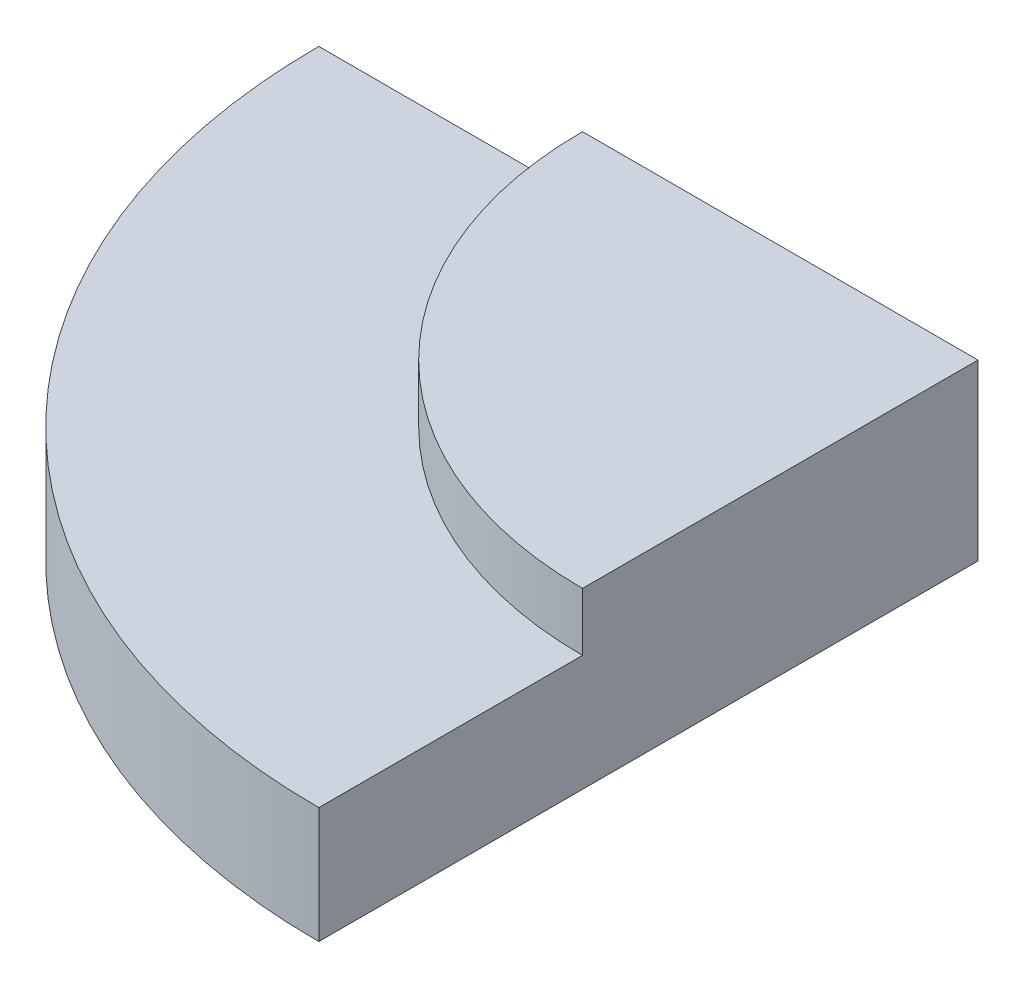
ISO-10303-21;
HEADER;
FILE_DESCRIPTION(('STEP AP214'),'2;1');
FILE_NAME('part.step','',(''),(''),'','','');
FILE_SCHEMA(('AUTOMOTIVE_DESIGN { 1 0 10303 214 1 1 1 1 }'));
ENDSEC;
DATA;
#1=APPLICATION_CONTEXT('core data for automotive mechanical design processes');
#2=APPLICATION_PROTOCOL_DEFINITION('international standard','automotive_design',2000,#1);
#3=PRODUCT_CONTEXT('',#1,'mechanical');
#4=PRODUCT('Part','Part','',(#3));
#5=PRODUCT_RELATED_PRODUCT_CATEGORY('part','',(#4));
#6=PRODUCT_DEFINITION_FORMATION('','',#4);
#7=PRODUCT_DEFINITION_CONTEXT('part definition',#1,'design');
#8=PRODUCT_DEFINITION('design','',#6,#7);
#9=PRODUCT_DEFINITION_SHAPE('','',#8);
#10=(LENGTH_UNIT() NAMED_UNIT(*) SI_UNIT(.MILLI.,.METRE.));
#11=(NAMED_UNIT(*) PLANE_ANGLE_UNIT() SI_UNIT($,.RADIAN.));
#12=(NAMED_UNIT(*) SI_UNIT($,.STERADIAN.) SOLID_ANGLE_UNIT());
#13=UNCERTAINTY_MEASURE_WITH_UNIT(LENGTH_MEASURE(1.E-05),#10,'distance_accuracy_value','');
#14=(GEOMETRIC_REPRESENTATION_CONTEXT(3) GLOBAL_UNCERTAINTY_ASSIGNED_CONTEXT((#13)) GLOBAL_UNIT_ASSIGNED_CONTEXT((#10,
#11,#12)) REPRESENTATION_CONTEXT('',''));
#15=CARTESIAN_POINT('',(0.,0.,0.));
#16=DIRECTION('',(0.,0.,1.));
#17=DIRECTION('',(1.,0.,0.));
#18=AXIS2_PLACEMENT_3D('',#15,#16,#17);
#19=CARTESIAN_POINT('',(-58.9975836693932,66.,58.9975836693932));
#20=DIRECTION('',(0.,-1.,0.));
#21=DIRECTION('',(0.,0.,-1.));
#22=AXIS2_PLACEMENT_3D('',#19,#20,#21);
#23=PLANE('',#22);
#24=CARTESIAN_POINT('',(0.,66.,0.));
#25=DIRECTION('',(0.,1.,0.));
#26=DIRECTION('',(0.,0.,1.));
#27=AXIS2_PLACEMENT_3D('',#24,#25,#26);
#28=CIRCLE('',#27,150.);
#29=CARTESIAN_POINT('',(0.,66.,150.));
#30=VERTEX_POINT('',#29);
#31=CARTESIAN_POINT('',(-150.,66.,0.));
#32=VERTEX_POINT('',#31);
#33=EDGE_CURVE('E20',#30,#32,#28,.F.);
#34=ORIENTED_EDGE('',*,*,#33,.F.);
#35=DIRECTION('',(0.,0.,-1.));
#36=VECTOR('',#35,1.);
#37=CARTESIAN_POINT('',(0.,66.,250.));
#38=LINE('',#37,#36);
#39=CARTESIAN_POINT('',(0.,66.,0.));
#40=VERTEX_POINT('',#39);
#41=EDGE_CURVE('E75',#40,#30,#38,.F.);
#42=ORIENTED_EDGE('',*,*,#41,.F.);
#43=DIRECTION('',(-1.,0.,0.));
#44=VECTOR('',#43,1.);
#45=CARTESIAN_POINT('',(0.,66.,0.));
#46=LINE('',#45,#44);
#47=EDGE_CURVE('E65',#32,#40,#46,.F.);
#48=ORIENTED_EDGE('',*,*,#47,.F.);
#49=EDGE_LOOP('',(#34,#42,#48));
#50=FACE_BOUND('',#49,.T.);
#51=ADVANCED_FACE('F17',(#50),#23,.F.);
#52=CARTESIAN_POINT('',(0.,44.,0.));
#53=DIRECTION('',(0.,1.,0.));
#54=DIRECTION('',(0.,0.,1.));
#55=AXIS2_PLACEMENT_3D('',#52,#53,#54);
#56=CYLINDRICAL_SURFACE('',#55,150.);
#57=ORIENTED_EDGE('',*,*,#33,.T.);
#58=DIRECTION('',(0.,1.,0.));
#59=VECTOR('',#58,1.);
#60=CARTESIAN_POINT('',(-150.,0.,0.));
#61=LINE('',#60,#59);
#62=CARTESIAN_POINT('',(-150.,44.,0.));
#63=VERTEX_POINT('',#62);
#64=EDGE_CURVE('E69',#63,#32,#61,.T.);
#65=ORIENTED_EDGE('',*,*,#64,.F.);
#66=CARTESIAN_POINT('',(0.,44.,0.));
#67=DIRECTION('',(0.,1.,0.));
#68=DIRECTION('',(0.,0.,1.));
#69=AXIS2_PLACEMENT_3D('',#66,#67,#68);
#70=CIRCLE('',#69,150.);
#71=CARTESIAN_POINT('',(0.,44.,150.));
#72=VERTEX_POINT('',#71);
#73=EDGE_CURVE('E74',#63,#72,#70,.T.);
#74=ORIENTED_EDGE('',*,*,#73,.T.);
#75=DIRECTION('',(0.,1.,0.));
#76=VECTOR('',#75,1.);
#77=CARTESIAN_POINT('',(0.,0.,150.));
#78=LINE('',#77,#76);
#79=EDGE_CURVE('E72',#30,#72,#78,.F.);
#80=ORIENTED_EDGE('',*,*,#79,.F.);
#81=EDGE_LOOP('',(#57,#65,#74,#80));
#82=FACE_BOUND('',#81,.T.);
#83=ADVANCED_FACE('F68',(#82),#56,.T.);
#84=CARTESIAN_POINT('',(-98.3293061156553,44.,98.3293061156553));
#85=DIRECTION('',(0.,-1.,0.));
#86=DIRECTION('',(0.,0.,-1.));
#87=AXIS2_PLACEMENT_3D('',#84,#85,#86);
#88=PLANE('',#87);
#89=DIRECTION('',(-1.,0.,0.));
#90=VECTOR('',#89,1.);
#91=CARTESIAN_POINT('',(0.,44.,0.));
#92=LINE('',#91,#90);
#93=CARTESIAN_POINT('',(-250.,44.,0.));
#94=VERTEX_POINT('',#93);
#95=EDGE_CURVE('E81',#94,#63,#92,.F.);
#96=ORIENTED_EDGE('',*,*,#95,.F.);
#97=CARTESIAN_POINT('',(0.,44.,0.));
#98=DIRECTION('',(0.,1.,0.));
#99=DIRECTION('',(0.,0.,1.));
#100=AXIS2_PLACEMENT_3D('',#97,#98,#99);
#101=CIRCLE('',#100,250.);
#102=CARTESIAN_POINT('',(0.,44.,250.));
#103=VERTEX_POINT('',#102);
#104=EDGE_CURVE('E87',#103,#94,#101,.F.);
#105=ORIENTED_EDGE('',*,*,#104,.F.);
#106=DIRECTION('',(0.,0.,-1.));
#107=VECTOR('',#106,1.);
#108=CARTESIAN_POINT('',(0.,44.,250.));
#109=LINE('',#108,#107);
#110=EDGE_CURVE('E93',#72,#103,#109,.F.);
#111=ORIENTED_EDGE('',*,*,#110,.F.);
#112=ORIENTED_EDGE('',*,*,#73,.F.);
#113=EDGE_LOOP('',(#96,#105,#111,#112));
#114=FACE_BOUND('',#113,.T.);
#115=ADVANCED_FACE('F94',(#114),#88,.F.);
#116=CARTESIAN_POINT('',(0.,0.,0.));
#117=DIRECTION('',(0.,0.,-1.));
#118=DIRECTION('',(-1.,0.,0.));
#119=AXIS2_PLACEMENT_3D('',#116,#117,#118);
#120=PLANE('',#119);
#121=ORIENTED_EDGE('',*,*,#47,.T.);
#122=DIRECTION('',(0.,1.,0.));
#123=VECTOR('',#122,1.);
#124=CARTESIAN_POINT('',(0.,0.,0.));
#125=LINE('',#124,#123);
#126=CARTESIAN_POINT('',(0.,0.,0.));
#127=VERTEX_POINT('',#126);
#128=EDGE_CURVE('E77',#127,#40,#125,.T.);
#129=ORIENTED_EDGE('',*,*,#128,.F.);
#130=DIRECTION('',(1.,0.,0.));
#131=VECTOR('',#130,1.);
#132=CARTESIAN_POINT('',(-98.3293061156553,0.,0.));
#133=LINE('',#132,#131);
#134=CARTESIAN_POINT('',(-250.,0.,0.));
#135=VERTEX_POINT('',#134);
#136=EDGE_CURVE('E108',#135,#127,#133,.T.);
#137=ORIENTED_EDGE('',*,*,#136,.F.);
#138=DIRECTION('',(0.,1.,0.));
#139=VECTOR('',#138,1.);
#140=CARTESIAN_POINT('',(-250.,0.,0.));
#141=LINE('',#140,#139);
#142=EDGE_CURVE('E89',#94,#135,#141,.F.);
#143=ORIENTED_EDGE('',*,*,#142,.F.);
#144=ORIENTED_EDGE('',*,*,#95,.T.);
#145=ORIENTED_EDGE('',*,*,#64,.T.);
#146=EDGE_LOOP('',(#121,#129,#137,#143,#144,#145));
#147=FACE_BOUND('',#146,.T.);
#148=ADVANCED_FACE('F79',(#147),#120,.T.);
#149=CARTESIAN_POINT('',(0.,0.,250.));
#150=DIRECTION('',(1.,0.,0.));
#151=DIRECTION('',(0.,0.,-1.));
#152=AXIS2_PLACEMENT_3D('',#149,#150,#151);
#153=PLANE('',#152);
#154=ORIENTED_EDGE('',*,*,#110,.T.);
#155=DIRECTION('',(0.,1.,0.));
#156=VECTOR('',#155,1.);
#157=CARTESIAN_POINT('',(0.,0.,250.));
#158=LINE('',#157,#156);
#159=CARTESIAN_POINT('',(0.,0.,250.));
#160=VERTEX_POINT('',#159);
#161=EDGE_CURVE('E35',#160,#103,#158,.T.);
#162=ORIENTED_EDGE('',*,*,#161,.F.);
#163=DIRECTION('',(0.,0.,-1.));
#164=VECTOR('',#163,1.);
#165=CARTESIAN_POINT('',(0.,0.,98.3293061156553));
#166=LINE('',#165,#164);
#167=EDGE_CURVE('E26',#127,#160,#166,.F.);
#168=ORIENTED_EDGE('',*,*,#167,.F.);
#169=ORIENTED_EDGE('',*,*,#128,.T.);
#170=ORIENTED_EDGE('',*,*,#41,.T.);
#171=ORIENTED_EDGE('',*,*,#79,.T.);
#172=EDGE_LOOP('',(#154,#162,#168,#169,#170,#171));
#173=FACE_BOUND('',#172,.T.);
#174=ADVANCED_FACE('F96',(#173),#153,.T.);
#175=CARTESIAN_POINT('',(0.,0.,0.));
#176=DIRECTION('',(0.,1.,0.));
#177=DIRECTION('',(0.,0.,1.));
#178=AXIS2_PLACEMENT_3D('',#175,#176,#177);
#179=CYLINDRICAL_SURFACE('',#178,250.);
#180=ORIENTED_EDGE('',*,*,#104,.T.);
#181=ORIENTED_EDGE('',*,*,#142,.T.);
#182=CARTESIAN_POINT('',(0.,0.,0.));
#183=DIRECTION('',(0.,1.,0.));
#184=DIRECTION('',(0.,0.,1.));
#185=AXIS2_PLACEMENT_3D('',#182,#183,#184);
#186=CIRCLE('',#185,250.);
#187=EDGE_CURVE('E11',#160,#135,#186,.F.);
#188=ORIENTED_EDGE('',*,*,#187,.F.);
#189=ORIENTED_EDGE('',*,*,#161,.T.);
#190=EDGE_LOOP('',(#180,#181,#188,#189));
#191=FACE_BOUND('',#190,.T.);
#192=ADVANCED_FACE('F119',(#191),#179,.T.);
#193=CARTESIAN_POINT('',(-98.3293061156553,0.,98.3293061156553));
#194=DIRECTION('',(0.,-1.,0.));
#195=DIRECTION('',(0.,0.,-1.));
#196=AXIS2_PLACEMENT_3D('',#193,#194,#195);
#197=PLANE('',#196);
#198=ORIENTED_EDGE('',*,*,#167,.T.);
#199=ORIENTED_EDGE('',*,*,#187,.T.);
#200=ORIENTED_EDGE('',*,*,#136,.T.);
#201=EDGE_LOOP('',(#198,#199,#200));
#202=FACE_BOUND('',#201,.T.);
#203=ADVANCED_FACE('F117',(#202),#197,.T.);
#204=CLOSED_SHELL('',(#51,#83,#115,#148,#174,#192,#203));
#205=MANIFOLD_SOLID_BREP('B1',#204);
#206=ADVANCED_BREP_SHAPE_REPRESENTATION('',(#18,#205),#14);
#207=SHAPE_DEFINITION_REPRESENTATION(#9,#206);
ENDSEC;
END-ISO-10303-21;
